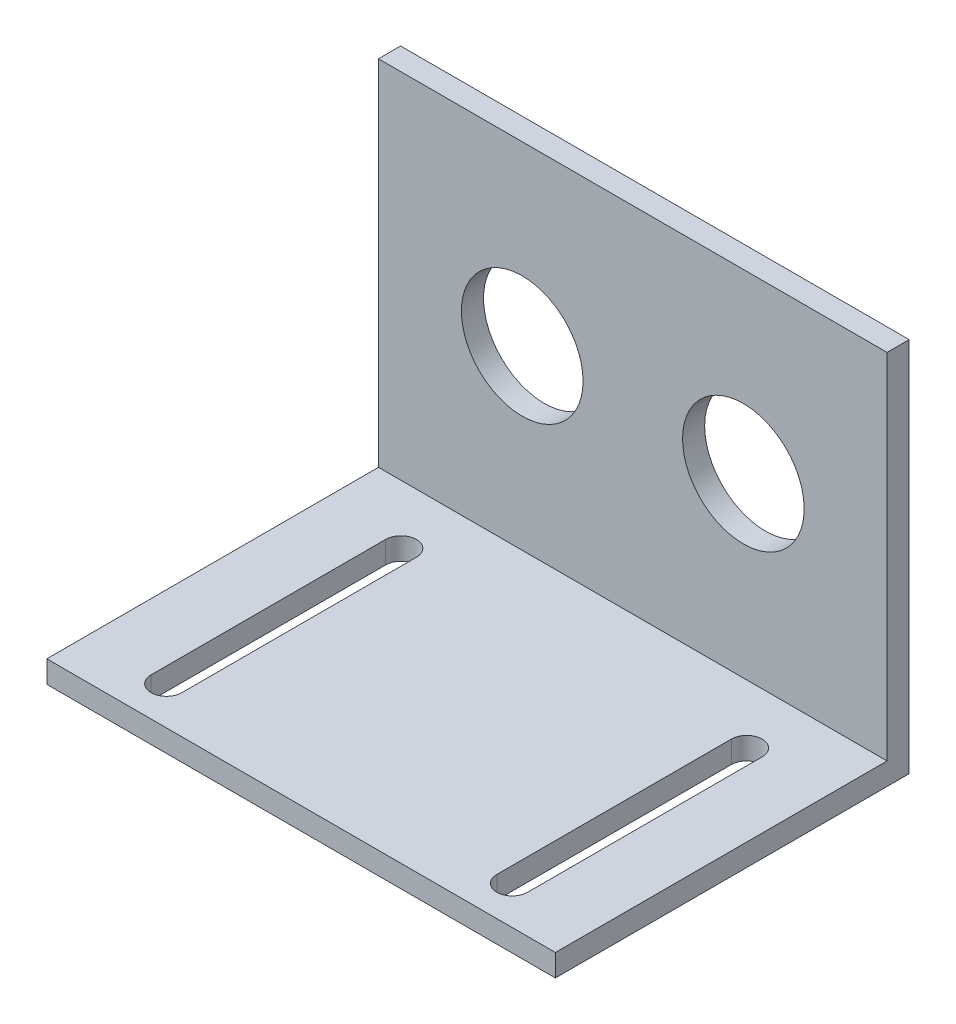
ISO-10303-21;
HEADER;
FILE_DESCRIPTION(('STEP AP214'),'2;1');
FILE_NAME('part.step','',(''),(''),'','','');
FILE_SCHEMA(('AUTOMOTIVE_DESIGN { 1 0 10303 214 1 1 1 1 }'));
ENDSEC;
DATA;
#1=APPLICATION_CONTEXT('core data for automotive mechanical design processes');
#2=APPLICATION_PROTOCOL_DEFINITION('international standard','automotive_design',2000,#1);
#3=PRODUCT_CONTEXT('',#1,'mechanical');
#4=PRODUCT('Part','Part','',(#3));
#5=PRODUCT_RELATED_PRODUCT_CATEGORY('part','',(#4));
#6=PRODUCT_DEFINITION_FORMATION('','',#4);
#7=PRODUCT_DEFINITION_CONTEXT('part definition',#1,'design');
#8=PRODUCT_DEFINITION('design','',#6,#7);
#9=PRODUCT_DEFINITION_SHAPE('','',#8);
#10=(LENGTH_UNIT() NAMED_UNIT(*) SI_UNIT(.MILLI.,.METRE.));
#11=(NAMED_UNIT(*) PLANE_ANGLE_UNIT() SI_UNIT($,.RADIAN.));
#12=(NAMED_UNIT(*) SI_UNIT($,.STERADIAN.) SOLID_ANGLE_UNIT());
#13=UNCERTAINTY_MEASURE_WITH_UNIT(LENGTH_MEASURE(1.E-05),#10,'distance_accuracy_value','');
#14=(GEOMETRIC_REPRESENTATION_CONTEXT(3) GLOBAL_UNCERTAINTY_ASSIGNED_CONTEXT((#13)) GLOBAL_UNIT_ASSIGNED_CONTEXT((#10,
#11,#12)) REPRESENTATION_CONTEXT('',''));
#15=CARTESIAN_POINT('',(0.,0.,0.));
#16=DIRECTION('',(0.,0.,1.));
#17=DIRECTION('',(1.,0.,0.));
#18=AXIS2_PLACEMENT_3D('',#15,#16,#17);
#19=CARTESIAN_POINT('',(15.7937241394591,34.,2.));
#20=DIRECTION('',(0.,-1.,0.));
#21=DIRECTION('',(0.,0.,-1.));
#22=AXIS2_PLACEMENT_3D('',#19,#20,#21);
#23=PLANE('',#22);
#24=DIRECTION('',(-1.,0.,0.));
#25=VECTOR('',#24,1.);
#26=CARTESIAN_POINT('',(15.7937241394591,34.,0.));
#27=LINE('',#26,#25);
#28=CARTESIAN_POINT('',(15.7937241394591,34.,0.));
#29=VERTEX_POINT('',#28);
#30=CARTESIAN_POINT('',(-30.2062758605409,34.,0.));
#31=VERTEX_POINT('',#30);
#32=EDGE_CURVE('E236',#29,#31,#27,.T.);
#33=ORIENTED_EDGE('',*,*,#32,.T.);
#34=DIRECTION('',(0.,0.,-1.));
#35=VECTOR('',#34,1.);
#36=CARTESIAN_POINT('',(-30.2062758605409,34.,2.));
#37=LINE('',#36,#35);
#38=CARTESIAN_POINT('',(-30.2062758605409,34.,2.));
#39=VERTEX_POINT('',#38);
#40=EDGE_CURVE('E11',#39,#31,#37,.T.);
#41=ORIENTED_EDGE('',*,*,#40,.F.);
#42=DIRECTION('',(-1.,0.,0.));
#43=VECTOR('',#42,1.);
#44=CARTESIAN_POINT('',(15.7937241394591,34.,2.));
#45=LINE('',#44,#43);
#46=CARTESIAN_POINT('',(15.7937241394591,34.,2.));
#47=VERTEX_POINT('',#46);
#48=EDGE_CURVE('E237',#47,#39,#45,.T.);
#49=ORIENTED_EDGE('',*,*,#48,.F.);
#50=DIRECTION('',(0.,0.,-1.));
#51=VECTOR('',#50,1.);
#52=CARTESIAN_POINT('',(15.7937241394591,34.,2.));
#53=LINE('',#52,#51);
#54=EDGE_CURVE('E245',#47,#29,#53,.T.);
#55=ORIENTED_EDGE('',*,*,#54,.T.);
#56=EDGE_LOOP('',(#33,#41,#49,#55));
#57=FACE_BOUND('',#56,.T.);
#58=ADVANCED_FACE('F35',(#57),#23,.F.);
#59=CARTESIAN_POINT('',(-30.2062758605409,34.,2.));
#60=DIRECTION('',(1.,0.,0.));
#61=DIRECTION('',(0.,0.,-1.));
#62=AXIS2_PLACEMENT_3D('',#59,#60,#61);
#63=PLANE('',#62);
#64=DIRECTION('',(0.,-1.,0.));
#65=VECTOR('',#64,1.);
#66=CARTESIAN_POINT('',(-30.2062758605409,34.,0.));
#67=LINE('',#66,#65);
#68=CARTESIAN_POINT('',(-30.2062758605409,0.,0.));
#69=VERTEX_POINT('',#68);
#70=EDGE_CURVE('E248',#31,#69,#67,.T.);
#71=ORIENTED_EDGE('',*,*,#70,.T.);
#72=DIRECTION('',(0.,0.,-1.));
#73=VECTOR('',#72,1.);
#74=CARTESIAN_POINT('',(-30.2062758605409,0.,2.));
#75=LINE('',#74,#73);
#76=CARTESIAN_POINT('',(-30.2062758605409,0.,32.));
#77=VERTEX_POINT('',#76);
#78=EDGE_CURVE('E42',#77,#69,#75,.T.);
#79=ORIENTED_EDGE('',*,*,#78,.F.);
#80=DIRECTION('',(0.,-1.,0.));
#81=VECTOR('',#80,1.);
#82=CARTESIAN_POINT('',(-30.2062758605409,0.,32.));
#83=LINE('',#82,#81);
#84=CARTESIAN_POINT('',(-30.2062758605409,2.,32.));
#85=VERTEX_POINT('',#84);
#86=EDGE_CURVE('E225',#85,#77,#83,.T.);
#87=ORIENTED_EDGE('',*,*,#86,.F.);
#88=DIRECTION('',(0.,0.,-1.));
#89=VECTOR('',#88,1.);
#90=CARTESIAN_POINT('',(-30.2062758605409,2.,32.));
#91=LINE('',#90,#89);
#92=CARTESIAN_POINT('',(-30.2062758605409,2.,2.));
#93=VERTEX_POINT('',#92);
#94=EDGE_CURVE('E228',#85,#93,#91,.T.);
#95=ORIENTED_EDGE('',*,*,#94,.T.);
#96=DIRECTION('',(0.,-1.,0.));
#97=VECTOR('',#96,1.);
#98=CARTESIAN_POINT('',(-30.2062758605409,34.,2.));
#99=LINE('',#98,#97);
#100=EDGE_CURVE('E240',#39,#93,#99,.T.);
#101=ORIENTED_EDGE('',*,*,#100,.F.);
#102=ORIENTED_EDGE('',*,*,#40,.T.);
#103=EDGE_LOOP('',(#71,#79,#87,#95,#101,#102));
#104=FACE_BOUND('',#103,.T.);
#105=ADVANCED_FACE('F284',(#104),#63,.F.);
#106=CARTESIAN_POINT('',(-30.2062758605409,0.,2.));
#107=DIRECTION('',(0.,1.,0.));
#108=DIRECTION('',(0.,0.,1.));
#109=AXIS2_PLACEMENT_3D('',#106,#107,#108);
#110=PLANE('',#109);
#111=DIRECTION('',(0.,0.,-1.));
#112=VECTOR('',#111,1.);
#113=CARTESIAN_POINT('',(-21.447575648557,0.,7.3283434429674));
#114=LINE('',#113,#112);
#115=CARTESIAN_POINT('',(-21.447575648557,0.,28.5399531080355));
#116=VERTEX_POINT('',#115);
#117=CARTESIAN_POINT('',(-21.447575648557,0.,7.3283434429674));
#118=VERTEX_POINT('',#117);
#119=EDGE_CURVE('E147',#116,#118,#114,.T.);
#120=ORIENTED_EDGE('',*,*,#119,.T.);
#121=CARTESIAN_POINT('',(-22.8416376239674,0.,7.3283434429674));
#122=DIRECTION('',(0.,1.,0.));
#123=DIRECTION('',(0.,0.,1.));
#124=AXIS2_PLACEMENT_3D('',#121,#122,#123);
#125=CIRCLE('',#124,1.3940619754104);
#126=CARTESIAN_POINT('',(-24.2356995993778,0.,7.3283434429674));
#127=VERTEX_POINT('',#126);
#128=EDGE_CURVE('E139',#118,#127,#125,.T.);
#129=ORIENTED_EDGE('',*,*,#128,.T.);
#130=DIRECTION('',(0.,0.,1.));
#131=VECTOR('',#130,1.);
#132=CARTESIAN_POINT('',(-24.2356995993778,0.,7.3283434429674));
#133=LINE('',#132,#131);
#134=CARTESIAN_POINT('',(-24.2356995993778,0.,28.5399531080355));
#135=VERTEX_POINT('',#134);
#136=EDGE_CURVE('E150',#127,#135,#133,.T.);
#137=ORIENTED_EDGE('',*,*,#136,.T.);
#138=CARTESIAN_POINT('',(-22.8416376239674,0.,28.5399531080355));
#139=DIRECTION('',(0.,1.,0.));
#140=DIRECTION('',(0.,0.,1.));
#141=AXIS2_PLACEMENT_3D('',#138,#139,#140);
#142=CIRCLE('',#141,1.3940619754104);
#143=EDGE_CURVE('E49',#135,#116,#142,.T.);
#144=ORIENTED_EDGE('',*,*,#143,.T.);
#145=EDGE_LOOP('',(#120,#129,#137,#144));
#146=FACE_BOUND('',#145,.T.);
#147=DIRECTION('',(0.,0.,1.));
#148=VECTOR('',#147,1.);
#149=CARTESIAN_POINT('',(7.03502392747519,0.,7.3283434429674));
#150=LINE('',#149,#148);
#151=CARTESIAN_POINT('',(7.03502392747519,0.,7.3283434429674));
#152=VERTEX_POINT('',#151);
#153=CARTESIAN_POINT('',(7.03502392747519,0.,28.5399531080355));
#154=VERTEX_POINT('',#153);
#155=EDGE_CURVE('E185',#152,#154,#150,.T.);
#156=ORIENTED_EDGE('',*,*,#155,.T.);
#157=CARTESIAN_POINT('',(8.42908590288559,0.,28.5399531080355));
#158=DIRECTION('',(0.,1.,0.));
#159=DIRECTION('',(0.,0.,-1.));
#160=AXIS2_PLACEMENT_3D('',#157,#158,#159);
#161=CIRCLE('',#160,1.3940619754104);
#162=CARTESIAN_POINT('',(9.823147878296,0.,28.5399531080355));
#163=VERTEX_POINT('',#162);
#164=EDGE_CURVE('E177',#154,#163,#161,.T.);
#165=ORIENTED_EDGE('',*,*,#164,.T.);
#166=DIRECTION('',(0.,0.,-1.));
#167=VECTOR('',#166,1.);
#168=CARTESIAN_POINT('',(9.823147878296,0.,7.3283434429674));
#169=LINE('',#168,#167);
#170=CARTESIAN_POINT('',(9.823147878296,0.,7.3283434429674));
#171=VERTEX_POINT('',#170);
#172=EDGE_CURVE('E180',#163,#171,#169,.T.);
#173=ORIENTED_EDGE('',*,*,#172,.T.);
#174=CARTESIAN_POINT('',(8.42908590288559,0.,7.3283434429674));
#175=DIRECTION('',(0.,1.,0.));
#176=DIRECTION('',(0.,0.,-1.));
#177=AXIS2_PLACEMENT_3D('',#174,#175,#176);
#178=CIRCLE('',#177,1.3940619754104);
#179=EDGE_CURVE('E57',#171,#152,#178,.T.);
#180=ORIENTED_EDGE('',*,*,#179,.T.);
#181=EDGE_LOOP('',(#156,#165,#173,#180));
#182=FACE_BOUND('',#181,.T.);
#183=DIRECTION('',(1.,0.,0.));
#184=VECTOR('',#183,1.);
#185=CARTESIAN_POINT('',(-30.2062758605409,0.,0.));
#186=LINE('',#185,#184);
#187=CARTESIAN_POINT('',(15.7937241394591,0.,0.));
#188=VERTEX_POINT('',#187);
#189=EDGE_CURVE('E250',#69,#188,#186,.T.);
#190=ORIENTED_EDGE('',*,*,#189,.T.);
#191=DIRECTION('',(0.,0.,-1.));
#192=VECTOR('',#191,1.);
#193=CARTESIAN_POINT('',(15.7937241394591,0.,2.));
#194=LINE('',#193,#192);
#195=CARTESIAN_POINT('',(15.7937241394591,0.,32.));
#196=VERTEX_POINT('',#195);
#197=EDGE_CURVE('E255',#196,#188,#194,.T.);
#198=ORIENTED_EDGE('',*,*,#197,.F.);
#199=DIRECTION('',(1.,0.,0.));
#200=VECTOR('',#199,1.);
#201=CARTESIAN_POINT('',(15.7937241394591,0.,32.));
#202=LINE('',#201,#200);
#203=EDGE_CURVE('E218',#77,#196,#202,.T.);
#204=ORIENTED_EDGE('',*,*,#203,.F.);
#205=ORIENTED_EDGE('',*,*,#78,.T.);
#206=EDGE_LOOP('',(#190,#198,#204,#205));
#207=FACE_BOUND('',#206,.T.);
#208=ADVANCED_FACE('F154',(#146,#182,#207),#110,.F.);
#209=CARTESIAN_POINT('',(15.7937241394591,0.,2.));
#210=DIRECTION('',(-1.,0.,0.));
#211=DIRECTION('',(0.,0.,1.));
#212=AXIS2_PLACEMENT_3D('',#209,#210,#211);
#213=PLANE('',#212);
#214=DIRECTION('',(0.,1.,0.));
#215=VECTOR('',#214,1.);
#216=CARTESIAN_POINT('',(15.7937241394591,0.,0.));
#217=LINE('',#216,#215);
#218=EDGE_CURVE('E241',#188,#29,#217,.T.);
#219=ORIENTED_EDGE('',*,*,#218,.T.);
#220=ORIENTED_EDGE('',*,*,#54,.F.);
#221=DIRECTION('',(0.,1.,0.));
#222=VECTOR('',#221,1.);
#223=CARTESIAN_POINT('',(15.7937241394591,0.,2.));
#224=LINE('',#223,#222);
#225=CARTESIAN_POINT('',(15.7937241394591,2.,2.));
#226=VERTEX_POINT('',#225);
#227=EDGE_CURVE('E243',#226,#47,#224,.T.);
#228=ORIENTED_EDGE('',*,*,#227,.F.);
#229=DIRECTION('',(0.,0.,-1.));
#230=VECTOR('',#229,1.);
#231=CARTESIAN_POINT('',(15.7937241394591,2.,32.));
#232=LINE('',#231,#230);
#233=CARTESIAN_POINT('',(15.7937241394591,2.,32.));
#234=VERTEX_POINT('',#233);
#235=EDGE_CURVE('E233',#234,#226,#232,.T.);
#236=ORIENTED_EDGE('',*,*,#235,.F.);
#237=DIRECTION('',(0.,1.,0.));
#238=VECTOR('',#237,1.);
#239=CARTESIAN_POINT('',(15.7937241394591,2.,32.));
#240=LINE('',#239,#238);
#241=EDGE_CURVE('E221',#196,#234,#240,.T.);
#242=ORIENTED_EDGE('',*,*,#241,.F.);
#243=ORIENTED_EDGE('',*,*,#197,.T.);
#244=EDGE_LOOP('',(#219,#220,#228,#236,#242,#243));
#245=FACE_BOUND('',#244,.T.);
#246=ADVANCED_FACE('F269',(#245),#213,.F.);
#247=CARTESIAN_POINT('',(0.,0.,2.));
#248=DIRECTION('',(0.,0.,1.));
#249=DIRECTION('',(1.,0.,0.));
#250=AXIS2_PLACEMENT_3D('',#247,#248,#249);
#251=PLANE('',#250);
#252=CARTESIAN_POINT('',(-17.2062758605409,18.,2.));
#253=DIRECTION('',(0.,0.,1.));
#254=DIRECTION('',(1.,0.,0.));
#255=AXIS2_PLACEMENT_3D('',#252,#253,#254);
#256=CIRCLE('',#255,5.5);
#257=CARTESIAN_POINT('',(-11.7062758605409,18.,2.));
#258=VERTEX_POINT('',#257);
#259=EDGE_CURVE('E210',#258,#258,#256,.T.);
#260=ORIENTED_EDGE('',*,*,#259,.F.);
#261=EDGE_LOOP('',(#260));
#262=FACE_BOUND('',#261,.T.);
#263=CARTESIAN_POINT('',(2.79372413945908,18.,2.));
#264=DIRECTION('',(0.,0.,1.));
#265=DIRECTION('',(-1.,0.,0.));
#266=AXIS2_PLACEMENT_3D('',#263,#264,#265);
#267=CIRCLE('',#266,5.5);
#268=CARTESIAN_POINT('',(-2.70627586054092,18.,2.));
#269=VERTEX_POINT('',#268);
#270=EDGE_CURVE('E173',#269,#269,#267,.T.);
#271=ORIENTED_EDGE('',*,*,#270,.F.);
#272=EDGE_LOOP('',(#271));
#273=FACE_BOUND('',#272,.T.);
#274=DIRECTION('',(-1.,0.,0.));
#275=VECTOR('',#274,1.);
#276=CARTESIAN_POINT('',(-30.2062758605409,2.,2.));
#277=LINE('',#276,#275);
#278=EDGE_CURVE('E209',#226,#93,#277,.T.);
#279=ORIENTED_EDGE('',*,*,#278,.F.);
#280=ORIENTED_EDGE('',*,*,#227,.T.);
#281=ORIENTED_EDGE('',*,*,#48,.T.);
#282=ORIENTED_EDGE('',*,*,#100,.T.);
#283=EDGE_LOOP('',(#279,#280,#281,#282));
#284=FACE_BOUND('',#283,.T.);
#285=ADVANCED_FACE('F276',(#262,#273,#284),#251,.T.);
#286=CARTESIAN_POINT('',(0.,0.,0.));
#287=DIRECTION('',(0.,0.,1.));
#288=DIRECTION('',(1.,0.,0.));
#289=AXIS2_PLACEMENT_3D('',#286,#287,#288);
#290=PLANE('',#289);
#291=CARTESIAN_POINT('',(-17.2062758605409,18.,0.));
#292=DIRECTION('',(0.,0.,1.));
#293=DIRECTION('',(1.,0.,0.));
#294=AXIS2_PLACEMENT_3D('',#291,#292,#293);
#295=CIRCLE('',#294,5.5);
#296=CARTESIAN_POINT('',(-11.7062758605409,18.,0.));
#297=VERTEX_POINT('',#296);
#298=EDGE_CURVE('E206',#297,#297,#295,.T.);
#299=ORIENTED_EDGE('',*,*,#298,.T.);
#300=EDGE_LOOP('',(#299));
#301=FACE_BOUND('',#300,.T.);
#302=CARTESIAN_POINT('',(2.79372413945908,18.,0.));
#303=DIRECTION('',(0.,0.,1.));
#304=DIRECTION('',(-1.,0.,0.));
#305=AXIS2_PLACEMENT_3D('',#302,#303,#304);
#306=CIRCLE('',#305,5.5);
#307=CARTESIAN_POINT('',(-2.70627586054092,18.,0.));
#308=VERTEX_POINT('',#307);
#309=EDGE_CURVE('E213',#308,#308,#306,.T.);
#310=ORIENTED_EDGE('',*,*,#309,.T.);
#311=EDGE_LOOP('',(#310));
#312=FACE_BOUND('',#311,.T.);
#313=ORIENTED_EDGE('',*,*,#32,.F.);
#314=ORIENTED_EDGE('',*,*,#218,.F.);
#315=ORIENTED_EDGE('',*,*,#189,.F.);
#316=ORIENTED_EDGE('',*,*,#70,.F.);
#317=EDGE_LOOP('',(#313,#314,#315,#316));
#318=FACE_BOUND('',#317,.T.);
#319=ADVANCED_FACE('F266',(#301,#312,#318),#290,.F.);
#320=CARTESIAN_POINT('',(-30.2062758605409,2.,32.));
#321=DIRECTION('',(0.,-1.,0.));
#322=DIRECTION('',(0.,0.,-1.));
#323=AXIS2_PLACEMENT_3D('',#320,#321,#322);
#324=PLANE('',#323);
#325=DIRECTION('',(0.,0.,1.));
#326=VECTOR('',#325,1.);
#327=CARTESIAN_POINT('',(-24.2356995993778,2.,7.3283434429674));
#328=LINE('',#327,#326);
#329=CARTESIAN_POINT('',(-24.2356995993778,2.,7.3283434429674));
#330=VERTEX_POINT('',#329);
#331=CARTESIAN_POINT('',(-24.2356995993778,2.,28.5399531080355));
#332=VERTEX_POINT('',#331);
#333=EDGE_CURVE('E166',#330,#332,#328,.T.);
#334=ORIENTED_EDGE('',*,*,#333,.F.);
#335=CARTESIAN_POINT('',(-22.8416376239674,2.,7.3283434429674));
#336=DIRECTION('',(0.,1.,0.));
#337=DIRECTION('',(0.,0.,1.));
#338=AXIS2_PLACEMENT_3D('',#335,#336,#337);
#339=CIRCLE('',#338,1.3940619754104);
#340=CARTESIAN_POINT('',(-21.447575648557,2.,7.3283434429674));
#341=VERTEX_POINT('',#340);
#342=EDGE_CURVE('E142',#341,#330,#339,.T.);
#343=ORIENTED_EDGE('',*,*,#342,.F.);
#344=DIRECTION('',(0.,0.,-1.));
#345=VECTOR('',#344,1.);
#346=CARTESIAN_POINT('',(-21.447575648557,2.,7.3283434429674));
#347=LINE('',#346,#345);
#348=CARTESIAN_POINT('',(-21.447575648557,2.,28.5399531080355));
#349=VERTEX_POINT('',#348);
#350=EDGE_CURVE('E157',#349,#341,#347,.T.);
#351=ORIENTED_EDGE('',*,*,#350,.F.);
#352=CARTESIAN_POINT('',(-22.8416376239674,2.,28.5399531080355));
#353=DIRECTION('',(0.,1.,0.));
#354=DIRECTION('',(0.,0.,1.));
#355=AXIS2_PLACEMENT_3D('',#352,#353,#354);
#356=CIRCLE('',#355,1.3940619754104);
#357=EDGE_CURVE('E160',#332,#349,#356,.T.);
#358=ORIENTED_EDGE('',*,*,#357,.F.);
#359=EDGE_LOOP('',(#334,#343,#351,#358));
#360=FACE_BOUND('',#359,.T.);
#361=DIRECTION('',(0.,0.,-1.));
#362=VECTOR('',#361,1.);
#363=CARTESIAN_POINT('',(9.823147878296,2.,7.3283434429674));
#364=LINE('',#363,#362);
#365=CARTESIAN_POINT('',(9.823147878296,2.,28.5399531080355));
#366=VERTEX_POINT('',#365);
#367=CARTESIAN_POINT('',(9.823147878296,2.,7.3283434429674));
#368=VERTEX_POINT('',#367);
#369=EDGE_CURVE('E191',#366,#368,#364,.T.);
#370=ORIENTED_EDGE('',*,*,#369,.F.);
#371=CARTESIAN_POINT('',(8.42908590288559,2.,28.5399531080355));
#372=DIRECTION('',(0.,1.,0.));
#373=DIRECTION('',(0.,0.,-1.));
#374=AXIS2_PLACEMENT_3D('',#371,#372,#373);
#375=CIRCLE('',#374,1.3940619754104);
#376=CARTESIAN_POINT('',(7.03502392747519,2.,28.5399531080355));
#377=VERTEX_POINT('',#376);
#378=EDGE_CURVE('E189',#377,#366,#375,.T.);
#379=ORIENTED_EDGE('',*,*,#378,.F.);
#380=DIRECTION('',(0.,0.,1.));
#381=VECTOR('',#380,1.);
#382=CARTESIAN_POINT('',(7.03502392747519,2.,7.3283434429674));
#383=LINE('',#382,#381);
#384=CARTESIAN_POINT('',(7.03502392747519,2.,7.3283434429674));
#385=VERTEX_POINT('',#384);
#386=EDGE_CURVE('E181',#385,#377,#383,.T.);
#387=ORIENTED_EDGE('',*,*,#386,.F.);
#388=CARTESIAN_POINT('',(8.42908590288559,2.,7.3283434429674));
#389=DIRECTION('',(0.,1.,0.));
#390=DIRECTION('',(0.,0.,-1.));
#391=AXIS2_PLACEMENT_3D('',#388,#389,#390);
#392=CIRCLE('',#391,1.3940619754104);
#393=EDGE_CURVE('E194',#368,#385,#392,.T.);
#394=ORIENTED_EDGE('',*,*,#393,.F.);
#395=EDGE_LOOP('',(#370,#379,#387,#394));
#396=FACE_BOUND('',#395,.T.);
#397=ORIENTED_EDGE('',*,*,#278,.T.);
#398=ORIENTED_EDGE('',*,*,#94,.F.);
#399=DIRECTION('',(-1.,0.,0.));
#400=VECTOR('',#399,1.);
#401=CARTESIAN_POINT('',(-30.2062758605409,2.,32.));
#402=LINE('',#401,#400);
#403=EDGE_CURVE('E223',#234,#85,#402,.T.);
#404=ORIENTED_EDGE('',*,*,#403,.F.);
#405=ORIENTED_EDGE('',*,*,#235,.T.);
#406=EDGE_LOOP('',(#397,#398,#404,#405));
#407=FACE_BOUND('',#406,.T.);
#408=ADVANCED_FACE('F280',(#360,#396,#407),#324,.F.);
#409=CARTESIAN_POINT('',(0.,0.,32.));
#410=DIRECTION('',(0.,0.,-1.));
#411=DIRECTION('',(-1.,0.,0.));
#412=AXIS2_PLACEMENT_3D('',#409,#410,#411);
#413=PLANE('',#412);
#414=ORIENTED_EDGE('',*,*,#203,.T.);
#415=ORIENTED_EDGE('',*,*,#241,.T.);
#416=ORIENTED_EDGE('',*,*,#403,.T.);
#417=ORIENTED_EDGE('',*,*,#86,.T.);
#418=EDGE_LOOP('',(#414,#415,#416,#417));
#419=FACE_BOUND('',#418,.T.);
#420=ADVANCED_FACE('F283',(#419),#413,.F.);
#421=CARTESIAN_POINT('',(2.79372413945908,18.,0.));
#422=DIRECTION('',(0.,0.,1.));
#423=DIRECTION('',(1.,0.,0.));
#424=AXIS2_PLACEMENT_3D('',#421,#422,#423);
#425=CYLINDRICAL_SURFACE('',#424,5.5);
#426=ORIENTED_EDGE('',*,*,#309,.F.);
#427=EDGE_LOOP('',(#426));
#428=FACE_BOUND('',#427,.T.);
#429=ORIENTED_EDGE('',*,*,#270,.T.);
#430=EDGE_LOOP('',(#429));
#431=FACE_BOUND('',#430,.T.);
#432=ADVANCED_FACE('F305',(#428,#431),#425,.F.);
#433=CARTESIAN_POINT('',(-17.2062758605409,18.,0.));
#434=DIRECTION('',(0.,0.,1.));
#435=DIRECTION('',(1.,0.,0.));
#436=AXIS2_PLACEMENT_3D('',#433,#434,#435);
#437=CYLINDRICAL_SURFACE('',#436,5.5);
#438=ORIENTED_EDGE('',*,*,#298,.F.);
#439=EDGE_LOOP('',(#438));
#440=FACE_BOUND('',#439,.T.);
#441=ORIENTED_EDGE('',*,*,#259,.T.);
#442=EDGE_LOOP('',(#441));
#443=FACE_BOUND('',#442,.T.);
#444=ADVANCED_FACE('F308',(#440,#443),#437,.F.);
#445=CARTESIAN_POINT('',(8.42908590288559,0.,28.5399531080355));
#446=DIRECTION('',(0.,1.,0.));
#447=DIRECTION('',(0.,0.,1.));
#448=AXIS2_PLACEMENT_3D('',#445,#446,#447);
#449=CYLINDRICAL_SURFACE('',#448,1.3940619754104);
#450=ORIENTED_EDGE('',*,*,#378,.T.);
#451=DIRECTION('',(0.,1.,0.));
#452=VECTOR('',#451,1.);
#453=CARTESIAN_POINT('',(9.823147878296,0.,28.5399531080355));
#454=LINE('',#453,#452);
#455=EDGE_CURVE('E188',#163,#366,#454,.T.);
#456=ORIENTED_EDGE('',*,*,#455,.F.);
#457=ORIENTED_EDGE('',*,*,#164,.F.);
#458=DIRECTION('',(0.,1.,0.));
#459=VECTOR('',#458,1.);
#460=CARTESIAN_POINT('',(7.03502392747519,0.,28.5399531080355));
#461=LINE('',#460,#459);
#462=EDGE_CURVE('E167',#154,#377,#461,.T.);
#463=ORIENTED_EDGE('',*,*,#462,.T.);
#464=EDGE_LOOP('',(#450,#456,#457,#463));
#465=FACE_BOUND('',#464,.T.);
#466=ADVANCED_FACE('F312',(#465),#449,.F.);
#467=CARTESIAN_POINT('',(7.03502392747519,0.,7.3283434429674));
#468=DIRECTION('',(-1.,0.,0.));
#469=DIRECTION('',(0.,0.,1.));
#470=AXIS2_PLACEMENT_3D('',#467,#468,#469);
#471=PLANE('',#470);
#472=ORIENTED_EDGE('',*,*,#386,.T.);
#473=ORIENTED_EDGE('',*,*,#462,.F.);
#474=ORIENTED_EDGE('',*,*,#155,.F.);
#475=DIRECTION('',(0.,1.,0.));
#476=VECTOR('',#475,1.);
#477=CARTESIAN_POINT('',(7.03502392747519,0.,7.3283434429674));
#478=LINE('',#477,#476);
#479=EDGE_CURVE('E200',#152,#385,#478,.T.);
#480=ORIENTED_EDGE('',*,*,#479,.T.);
#481=EDGE_LOOP('',(#472,#473,#474,#480));
#482=FACE_BOUND('',#481,.T.);
#483=ADVANCED_FACE('F316',(#482),#471,.F.);
#484=CARTESIAN_POINT('',(8.42908590288559,0.,7.3283434429674));
#485=DIRECTION('',(0.,1.,0.));
#486=DIRECTION('',(0.,0.,1.));
#487=AXIS2_PLACEMENT_3D('',#484,#485,#486);
#488=CYLINDRICAL_SURFACE('',#487,1.3940619754104);
#489=ORIENTED_EDGE('',*,*,#393,.T.);
#490=ORIENTED_EDGE('',*,*,#479,.F.);
#491=ORIENTED_EDGE('',*,*,#179,.F.);
#492=DIRECTION('',(0.,1.,0.));
#493=VECTOR('',#492,1.);
#494=CARTESIAN_POINT('',(9.823147878296,0.,7.3283434429674));
#495=LINE('',#494,#493);
#496=EDGE_CURVE('E202',#171,#368,#495,.T.);
#497=ORIENTED_EDGE('',*,*,#496,.T.);
#498=EDGE_LOOP('',(#489,#490,#491,#497));
#499=FACE_BOUND('',#498,.T.);
#500=ADVANCED_FACE('F321',(#499),#488,.F.);
#501=CARTESIAN_POINT('',(9.823147878296,0.,7.3283434429674));
#502=DIRECTION('',(1.,0.,0.));
#503=DIRECTION('',(0.,0.,-1.));
#504=AXIS2_PLACEMENT_3D('',#501,#502,#503);
#505=PLANE('',#504);
#506=ORIENTED_EDGE('',*,*,#369,.T.);
#507=ORIENTED_EDGE('',*,*,#496,.F.);
#508=ORIENTED_EDGE('',*,*,#172,.F.);
#509=ORIENTED_EDGE('',*,*,#455,.T.);
#510=EDGE_LOOP('',(#506,#507,#508,#509));
#511=FACE_BOUND('',#510,.T.);
#512=ADVANCED_FACE('F318',(#511),#505,.F.);
#513=CARTESIAN_POINT('',(-22.8416376239674,0.,7.3283434429674));
#514=DIRECTION('',(0.,1.,0.));
#515=DIRECTION('',(0.,0.,1.));
#516=AXIS2_PLACEMENT_3D('',#513,#514,#515);
#517=CYLINDRICAL_SURFACE('',#516,1.3940619754104);
#518=ORIENTED_EDGE('',*,*,#342,.T.);
#519=DIRECTION('',(0.,1.,0.));
#520=VECTOR('',#519,1.);
#521=CARTESIAN_POINT('',(-24.2356995993778,0.,7.3283434429674));
#522=LINE('',#521,#520);
#523=EDGE_CURVE('E135',#127,#330,#522,.T.);
#524=ORIENTED_EDGE('',*,*,#523,.F.);
#525=ORIENTED_EDGE('',*,*,#128,.F.);
#526=DIRECTION('',(0.,1.,0.));
#527=VECTOR('',#526,1.);
#528=CARTESIAN_POINT('',(-21.447575648557,0.,7.3283434429674));
#529=LINE('',#528,#527);
#530=EDGE_CURVE('E171',#118,#341,#529,.T.);
#531=ORIENTED_EDGE('',*,*,#530,.T.);
#532=EDGE_LOOP('',(#518,#524,#525,#531));
#533=FACE_BOUND('',#532,.T.);
#534=ADVANCED_FACE('F137',(#533),#517,.F.);
#535=CARTESIAN_POINT('',(-21.447575648557,0.,7.3283434429674));
#536=DIRECTION('',(1.,0.,0.));
#537=DIRECTION('',(0.,0.,-1.));
#538=AXIS2_PLACEMENT_3D('',#535,#536,#537);
#539=PLANE('',#538);
#540=ORIENTED_EDGE('',*,*,#350,.T.);
#541=ORIENTED_EDGE('',*,*,#530,.F.);
#542=ORIENTED_EDGE('',*,*,#119,.F.);
#543=DIRECTION('',(0.,1.,0.));
#544=VECTOR('',#543,1.);
#545=CARTESIAN_POINT('',(-21.447575648557,0.,28.5399531080355));
#546=LINE('',#545,#544);
#547=EDGE_CURVE('E174',#116,#349,#546,.T.);
#548=ORIENTED_EDGE('',*,*,#547,.T.);
#549=EDGE_LOOP('',(#540,#541,#542,#548));
#550=FACE_BOUND('',#549,.T.);
#551=ADVANCED_FACE('F330',(#550),#539,.F.);
#552=CARTESIAN_POINT('',(-22.8416376239674,0.,28.5399531080355));
#553=DIRECTION('',(0.,1.,0.));
#554=DIRECTION('',(0.,0.,1.));
#555=AXIS2_PLACEMENT_3D('',#552,#553,#554);
#556=CYLINDRICAL_SURFACE('',#555,1.3940619754104);
#557=ORIENTED_EDGE('',*,*,#357,.T.);
#558=ORIENTED_EDGE('',*,*,#547,.F.);
#559=ORIENTED_EDGE('',*,*,#143,.F.);
#560=DIRECTION('',(0.,1.,0.));
#561=VECTOR('',#560,1.);
#562=CARTESIAN_POINT('',(-24.2356995993778,0.,28.5399531080355));
#563=LINE('',#562,#561);
#564=EDGE_CURVE('E146',#135,#332,#563,.T.);
#565=ORIENTED_EDGE('',*,*,#564,.T.);
#566=EDGE_LOOP('',(#557,#558,#559,#565));
#567=FACE_BOUND('',#566,.T.);
#568=ADVANCED_FACE('F333',(#567),#556,.F.);
#569=CARTESIAN_POINT('',(-24.2356995993778,0.,7.3283434429674));
#570=DIRECTION('',(-1.,0.,0.));
#571=DIRECTION('',(0.,0.,1.));
#572=AXIS2_PLACEMENT_3D('',#569,#570,#571);
#573=PLANE('',#572);
#574=ORIENTED_EDGE('',*,*,#333,.T.);
#575=ORIENTED_EDGE('',*,*,#564,.F.);
#576=ORIENTED_EDGE('',*,*,#136,.F.);
#577=ORIENTED_EDGE('',*,*,#523,.T.);
#578=EDGE_LOOP('',(#574,#575,#576,#577));
#579=FACE_BOUND('',#578,.T.);
#580=ADVANCED_FACE('F151',(#579),#573,.F.);
#581=CLOSED_SHELL('',(#58,#105,#208,#246,#285,#319,#408,#420,#432,#444,#466,#483,#500,#512,#534,
#551,#568,#580));
#582=MANIFOLD_SOLID_BREP('B2',#581);
#583=ADVANCED_BREP_SHAPE_REPRESENTATION('',(#18,#582),#14);
#584=SHAPE_DEFINITION_REPRESENTATION(#9,#583);
ENDSEC;
END-ISO-10303-21;
